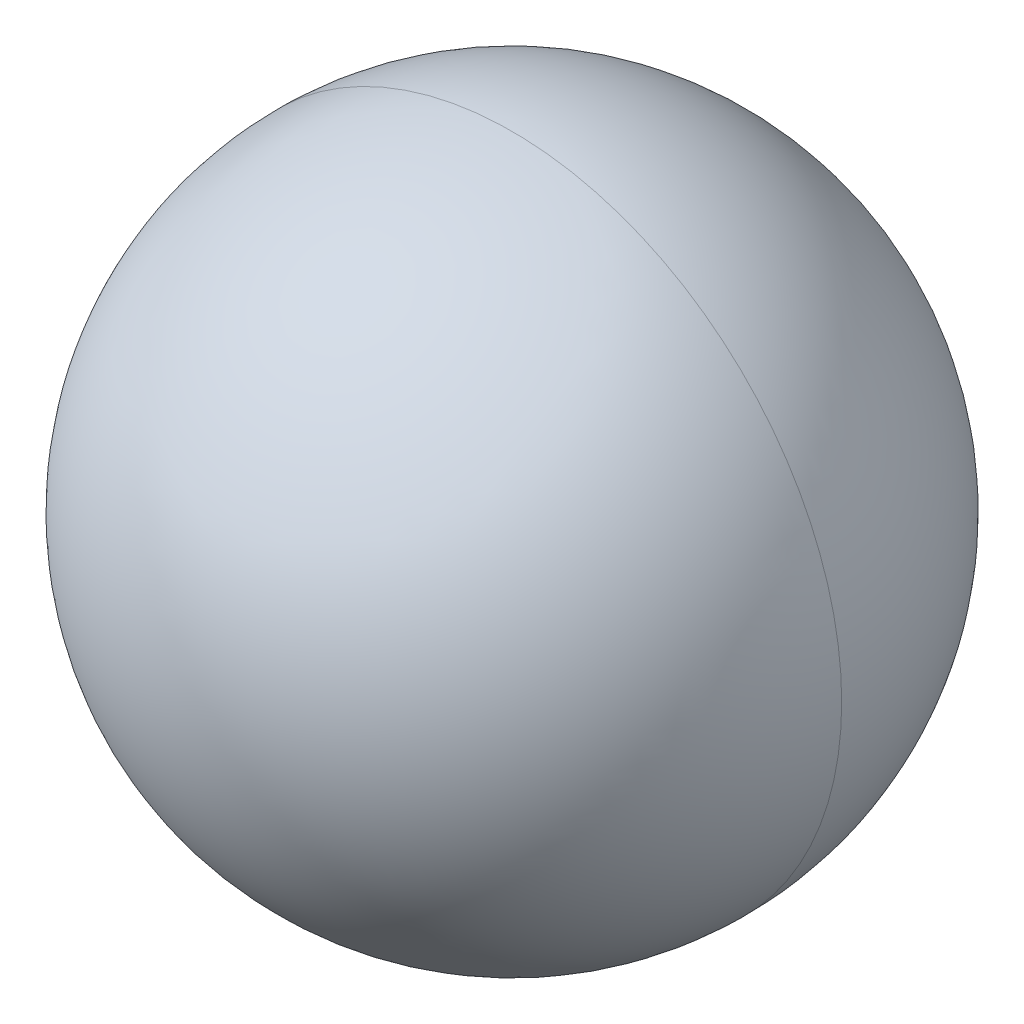
ISO-10303-21;
HEADER;
FILE_DESCRIPTION(('STEP AP214'),'2;1');
FILE_NAME('part.step','',(''),(''),'','','');
FILE_SCHEMA(('AUTOMOTIVE_DESIGN { 1 0 10303 214 1 1 1 1 }'));
ENDSEC;
DATA;
#1=APPLICATION_CONTEXT('core data for automotive mechanical design processes');
#2=APPLICATION_PROTOCOL_DEFINITION('international standard','automotive_design',2000,#1);
#3=PRODUCT_CONTEXT('',#1,'mechanical');
#4=PRODUCT('Part','Part','',(#3));
#5=PRODUCT_RELATED_PRODUCT_CATEGORY('part','',(#4));
#6=PRODUCT_DEFINITION_FORMATION('','',#4);
#7=PRODUCT_DEFINITION_CONTEXT('part definition',#1,'design');
#8=PRODUCT_DEFINITION('design','',#6,#7);
#9=PRODUCT_DEFINITION_SHAPE('','',#8);
#10=(LENGTH_UNIT() NAMED_UNIT(*) SI_UNIT(.MILLI.,.METRE.));
#11=(NAMED_UNIT(*) PLANE_ANGLE_UNIT() SI_UNIT($,.RADIAN.));
#12=(NAMED_UNIT(*) SI_UNIT($,.STERADIAN.) SOLID_ANGLE_UNIT());
#13=UNCERTAINTY_MEASURE_WITH_UNIT(LENGTH_MEASURE(1.E-05),#10,'distance_accuracy_value','');
#14=(GEOMETRIC_REPRESENTATION_CONTEXT(3) GLOBAL_UNCERTAINTY_ASSIGNED_CONTEXT((#13)) GLOBAL_UNIT_ASSIGNED_CONTEXT((#10,
#11,#12)) REPRESENTATION_CONTEXT('',''));
#15=CARTESIAN_POINT('',(0.,0.,0.));
#16=DIRECTION('',(0.,0.,1.));
#17=DIRECTION('',(1.,0.,0.));
#18=AXIS2_PLACEMENT_3D('',#15,#16,#17);
#19=CARTESIAN_POINT('',(5.,32.5,0.));
#20=DIRECTION('',(1.,0.,0.));
#21=DIRECTION('',(0.,0.,-1.));
#22=AXIS2_PLACEMENT_3D('',#19,#20,#21);
#23=SPHERICAL_SURFACE('',#22,3.572);
#24=CARTESIAN_POINT('',(5.,32.5,0.));
#25=DIRECTION('',(0.,0.,1.));
#26=DIRECTION('',(1.,0.,0.));
#27=AXIS2_PLACEMENT_3D('',#24,#25,#26);
#28=CIRCLE('',#27,3.572);
#29=CARTESIAN_POINT('',(8.572,32.5,0.));
#30=VERTEX_POINT('',#29);
#31=CARTESIAN_POINT('',(1.428,32.5,0.));
#32=VERTEX_POINT('',#31);
#33=EDGE_CURVE('E11',#30,#32,#28,.T.);
#34=ORIENTED_EDGE('',*,*,#33,.T.);
#35=CARTESIAN_POINT('',(5.,32.5,0.));
#36=DIRECTION('',(0.,0.,-1.));
#37=DIRECTION('',(1.,0.,0.));
#38=AXIS2_PLACEMENT_3D('',#35,#36,#37);
#39=CIRCLE('',#38,3.572);
#40=EDGE_CURVE('E25',#30,#32,#39,.T.);
#41=ORIENTED_EDGE('',*,*,#40,.F.);
#42=EDGE_LOOP('',(#34,#41));
#43=FACE_BOUND('',#42,.T.);
#44=ADVANCED_FACE('F17',(#43),#23,.T.);
#45=CARTESIAN_POINT('',(5.,32.5,0.));
#46=DIRECTION('',(1.,0.,0.));
#47=DIRECTION('',(0.,0.,1.));
#48=AXIS2_PLACEMENT_3D('',#45,#46,#47);
#49=SPHERICAL_SURFACE('',#48,3.572);
#50=ORIENTED_EDGE('',*,*,#33,.F.);
#51=ORIENTED_EDGE('',*,*,#40,.T.);
#52=EDGE_LOOP('',(#50,#51));
#53=FACE_BOUND('',#52,.T.);
#54=ADVANCED_FACE('F33',(#53),#49,.T.);
#55=CLOSED_SHELL('',(#44,#54));
#56=MANIFOLD_SOLID_BREP('B1',#55);
#57=ADVANCED_BREP_SHAPE_REPRESENTATION('',(#18,#56),#14);
#58=SHAPE_DEFINITION_REPRESENTATION(#9,#57);
ENDSEC;
END-ISO-10303-21;
